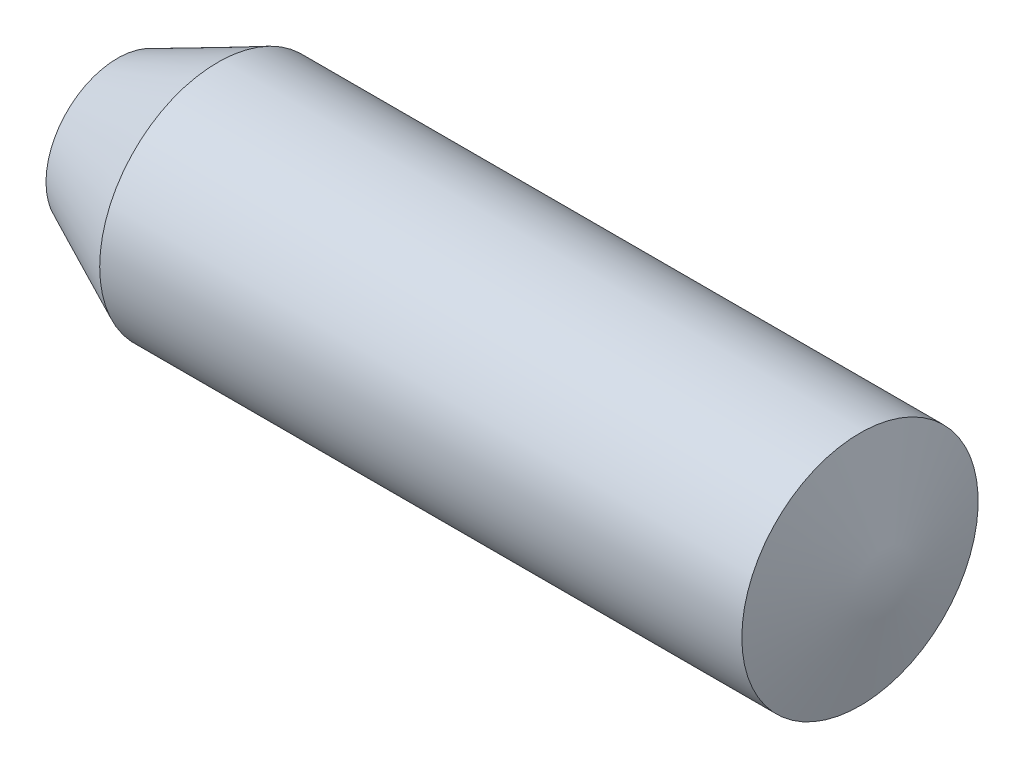
ISO-10303-21;
HEADER;
FILE_DESCRIPTION(('STEP AP214'),'2;1');
FILE_NAME('part.step','',(''),(''),'','','');
FILE_SCHEMA(('AUTOMOTIVE_DESIGN { 1 0 10303 214 1 1 1 1 }'));
ENDSEC;
DATA;
#1=APPLICATION_CONTEXT('core data for automotive mechanical design processes');
#2=APPLICATION_PROTOCOL_DEFINITION('international standard','automotive_design',2000,#1);
#3=PRODUCT_CONTEXT('',#1,'mechanical');
#4=PRODUCT('Part','Part','',(#3));
#5=PRODUCT_RELATED_PRODUCT_CATEGORY('part','',(#4));
#6=PRODUCT_DEFINITION_FORMATION('','',#4);
#7=PRODUCT_DEFINITION_CONTEXT('part definition',#1,'design');
#8=PRODUCT_DEFINITION('design','',#6,#7);
#9=PRODUCT_DEFINITION_SHAPE('','',#8);
#10=(LENGTH_UNIT() NAMED_UNIT(*) SI_UNIT(.MILLI.,.METRE.));
#11=(NAMED_UNIT(*) PLANE_ANGLE_UNIT() SI_UNIT($,.RADIAN.));
#12=(NAMED_UNIT(*) SI_UNIT($,.STERADIAN.) SOLID_ANGLE_UNIT());
#13=UNCERTAINTY_MEASURE_WITH_UNIT(LENGTH_MEASURE(1.E-05),#10,'distance_accuracy_value','');
#14=(GEOMETRIC_REPRESENTATION_CONTEXT(3) GLOBAL_UNCERTAINTY_ASSIGNED_CONTEXT((#13)) GLOBAL_UNIT_ASSIGNED_CONTEXT((#10,
#11,#12)) REPRESENTATION_CONTEXT('',''));
#15=CARTESIAN_POINT('',(0.,0.,0.));
#16=DIRECTION('',(0.,0.,1.));
#17=DIRECTION('',(1.,0.,0.));
#18=AXIS2_PLACEMENT_3D('',#15,#16,#17);
#19=CARTESIAN_POINT('',(1828.8,0.,0.));
#20=DIRECTION('',(-1.,0.,0.));
#21=DIRECTION('',(0.,0.,1.));
#22=AXIS2_PLACEMENT_3D('',#19,#20,#21);
#23=CONICAL_SURFACE('',#22,0.,1.31425871356946);
#24=CARTESIAN_POINT('',(1755.50848282073,0.,0.));
#25=DIRECTION('',(-1.,0.,0.));
#26=DIRECTION('',(0.,0.,1.));
#27=AXIS2_PLACEMENT_3D('',#24,#25,#26);
#28=CIRCLE('',#27,279.4);
#29=CARTESIAN_POINT('',(1755.50848282073,0.,279.4));
#30=VERTEX_POINT('',#29);
#31=EDGE_CURVE('E11',#30,#30,#28,.T.);
#32=ORIENTED_EDGE('',*,*,#31,.F.);
#33=EDGE_LOOP('',(#32));
#34=FACE_BOUND('',#33,.T.);
#35=CARTESIAN_POINT('',(1828.8,0.,0.));
#36=VERTEX_POINT('',#35);
#37=VERTEX_LOOP('',#36);
#38=FACE_BOUND('',#37,.T.);
#39=ADVANCED_FACE('F40',(#34,#38),#23,.T.);
#40=CARTESIAN_POINT('',(0.,0.,0.));
#41=DIRECTION('',(-1.,0.,0.));
#42=DIRECTION('',(0.,0.,1.));
#43=AXIS2_PLACEMENT_3D('',#40,#41,#42);
#44=CYLINDRICAL_SURFACE('',#43,279.4);
#45=CARTESIAN_POINT('',(237.245718474749,0.,0.));
#46=DIRECTION('',(-1.,0.,0.));
#47=DIRECTION('',(0.,0.,1.));
#48=AXIS2_PLACEMENT_3D('',#45,#46,#47);
#49=CIRCLE('',#48,279.4);
#50=CARTESIAN_POINT('',(237.245718474749,0.,279.4));
#51=VERTEX_POINT('',#50);
#52=EDGE_CURVE('E47',#51,#51,#49,.T.);
#53=ORIENTED_EDGE('',*,*,#52,.F.);
#54=EDGE_LOOP('',(#53));
#55=FACE_BOUND('',#54,.T.);
#56=ORIENTED_EDGE('',*,*,#31,.T.);
#57=EDGE_LOOP('',(#56));
#58=FACE_BOUND('',#57,.T.);
#59=ADVANCED_FACE('F51',(#55,#58),#44,.T.);
#60=CARTESIAN_POINT('',(237.245718474749,0.,0.));
#61=DIRECTION('',(1.,0.,0.));
#62=DIRECTION('',(0.,0.,-1.));
#63=AXIS2_PLACEMENT_3D('',#60,#61,#62);
#64=CONICAL_SURFACE('',#63,279.4,0.435201768616676);
#65=CARTESIAN_POINT('',(0.,0.,0.));
#66=DIRECTION('',(-1.,0.,0.));
#67=DIRECTION('',(0.,0.,1.));
#68=AXIS2_PLACEMENT_3D('',#65,#66,#67);
#69=CIRCLE('',#68,169.096871333114);
#70=CARTESIAN_POINT('',(0.,0.,169.096871333114));
#71=VERTEX_POINT('',#70);
#72=EDGE_CURVE('E74',#71,#71,#69,.T.);
#73=ORIENTED_EDGE('',*,*,#72,.F.);
#74=EDGE_LOOP('',(#73));
#75=FACE_BOUND('',#74,.T.);
#76=ORIENTED_EDGE('',*,*,#52,.T.);
#77=EDGE_LOOP('',(#76));
#78=FACE_BOUND('',#77,.T.);
#79=ADVANCED_FACE('F56',(#75,#78),#64,.T.);
#80=CARTESIAN_POINT('',(0.,0.,0.));
#81=DIRECTION('',(1.,0.,0.));
#82=DIRECTION('',(0.,0.,-1.));
#83=AXIS2_PLACEMENT_3D('',#80,#81,#82);
#84=PLANE('',#83);
#85=ORIENTED_EDGE('',*,*,#72,.T.);
#86=EDGE_LOOP('',(#85));
#87=FACE_BOUND('',#86,.T.);
#88=ADVANCED_FACE('F63',(#87),#84,.F.);
#89=CLOSED_SHELL('',(#39,#59,#79,#88));
#90=MANIFOLD_SOLID_BREP('B2',#89);
#91=ADVANCED_BREP_SHAPE_REPRESENTATION('',(#18,#90),#14);
#92=SHAPE_DEFINITION_REPRESENTATION(#9,#91);
ENDSEC;
END-ISO-10303-21;
